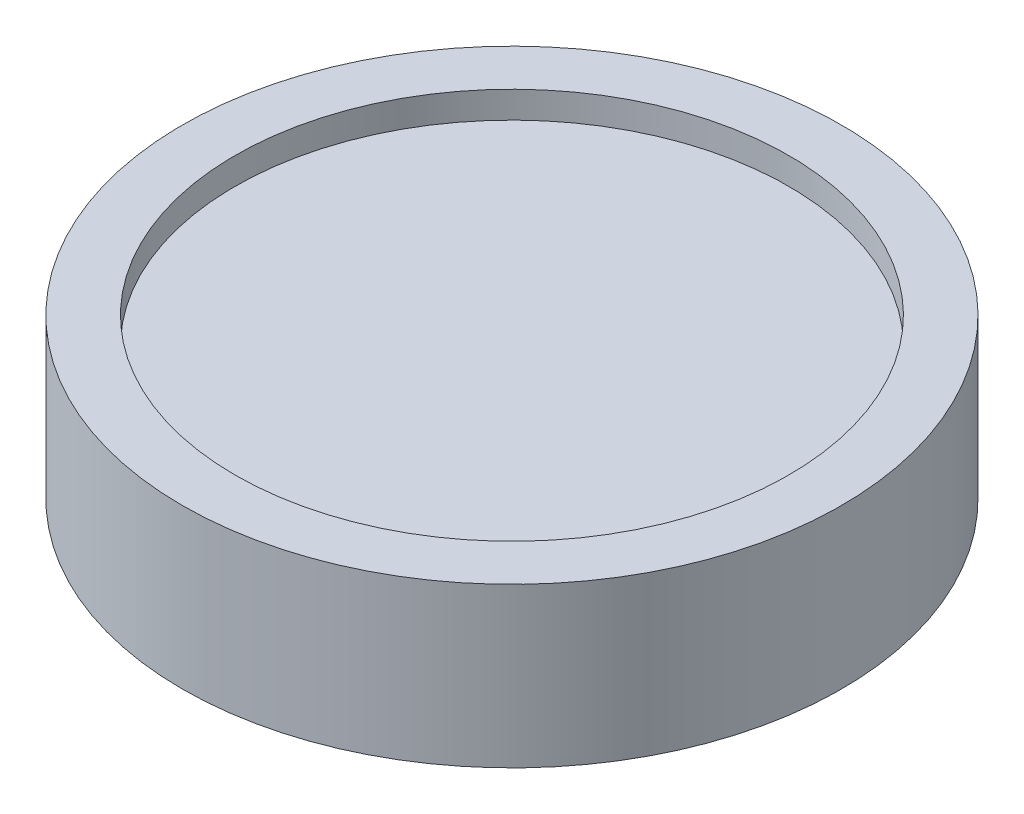
ISO-10303-21;
HEADER;
FILE_DESCRIPTION(('STEP AP214'),'2;1');
FILE_NAME('part.step','',(''),(''),'','','');
FILE_SCHEMA(('AUTOMOTIVE_DESIGN { 1 0 10303 214 1 1 1 1 }'));
ENDSEC;
DATA;
#1=APPLICATION_CONTEXT('core data for automotive mechanical design processes');
#2=APPLICATION_PROTOCOL_DEFINITION('international standard','automotive_design',2000,#1);
#3=PRODUCT_CONTEXT('',#1,'mechanical');
#4=PRODUCT('Part','Part','',(#3));
#5=PRODUCT_RELATED_PRODUCT_CATEGORY('part','',(#4));
#6=PRODUCT_DEFINITION_FORMATION('','',#4);
#7=PRODUCT_DEFINITION_CONTEXT('part definition',#1,'design');
#8=PRODUCT_DEFINITION('design','',#6,#7);
#9=PRODUCT_DEFINITION_SHAPE('','',#8);
#10=(LENGTH_UNIT() NAMED_UNIT(*) SI_UNIT(.MILLI.,.METRE.));
#11=(NAMED_UNIT(*) PLANE_ANGLE_UNIT() SI_UNIT($,.RADIAN.));
#12=(NAMED_UNIT(*) SI_UNIT($,.STERADIAN.) SOLID_ANGLE_UNIT());
#13=UNCERTAINTY_MEASURE_WITH_UNIT(LENGTH_MEASURE(1.E-05),#10,'distance_accuracy_value','');
#14=(GEOMETRIC_REPRESENTATION_CONTEXT(3) GLOBAL_UNCERTAINTY_ASSIGNED_CONTEXT((#13)) GLOBAL_UNIT_ASSIGNED_CONTEXT((#10,
#11,#12)) REPRESENTATION_CONTEXT('',''));
#15=CARTESIAN_POINT('',(0.,0.,0.));
#16=DIRECTION('',(0.,0.,1.));
#17=DIRECTION('',(1.,0.,0.));
#18=AXIS2_PLACEMENT_3D('',#15,#16,#17);
#19=CARTESIAN_POINT('',(0.,2.,0.));
#20=DIRECTION('',(0.,1.,0.));
#21=DIRECTION('',(0.,0.,1.));
#22=AXIS2_PLACEMENT_3D('',#19,#20,#21);
#23=PLANE('',#22);
#24=CARTESIAN_POINT('',(0.,2.,0.));
#25=DIRECTION('',(0.,1.,0.));
#26=DIRECTION('',(0.,0.,1.));
#27=AXIS2_PLACEMENT_3D('',#24,#25,#26);
#28=CIRCLE('',#27,10.5);
#29=CARTESIAN_POINT('',(0.,2.,10.5));
#30=VERTEX_POINT('',#29);
#31=EDGE_CURVE('E36',#30,#30,#28,.T.);
#32=ORIENTED_EDGE('',*,*,#31,.T.);
#33=EDGE_LOOP('',(#32));
#34=FACE_BOUND('',#33,.T.);
#35=ADVANCED_FACE('F30',(#34),#23,.T.);
#36=CARTESIAN_POINT('',(0.,-3.015,0.));
#37=DIRECTION('',(0.,1.,0.));
#38=DIRECTION('',(0.,0.,1.));
#39=AXIS2_PLACEMENT_3D('',#36,#37,#38);
#40=CYLINDRICAL_SURFACE('',#39,10.5);
#41=CARTESIAN_POINT('',(0.,-3.015,0.));
#42=DIRECTION('',(0.,1.,0.));
#43=DIRECTION('',(0.,0.,1.));
#44=AXIS2_PLACEMENT_3D('',#41,#42,#43);
#45=CIRCLE('',#44,10.5);
#46=CARTESIAN_POINT('',(0.,-3.015,10.5));
#47=VERTEX_POINT('',#46);
#48=EDGE_CURVE('E44',#47,#47,#45,.T.);
#49=ORIENTED_EDGE('',*,*,#48,.F.);
#50=EDGE_LOOP('',(#49));
#51=FACE_BOUND('',#50,.T.);
#52=CARTESIAN_POINT('',(0.,-2.,0.));
#53=DIRECTION('',(0.,1.,0.));
#54=DIRECTION('',(0.,0.,1.));
#55=AXIS2_PLACEMENT_3D('',#52,#53,#54);
#56=CIRCLE('',#55,10.5);
#57=CARTESIAN_POINT('',(0.,-2.,10.5));
#58=VERTEX_POINT('',#57);
#59=EDGE_CURVE('E10',#58,#58,#56,.T.);
#60=ORIENTED_EDGE('',*,*,#59,.T.);
#61=EDGE_LOOP('',(#60));
#62=FACE_BOUND('',#61,.T.);
#63=ADVANCED_FACE('F71',(#51,#62),#40,.F.);
#64=CARTESIAN_POINT('',(0.,-3.015,0.));
#65=DIRECTION('',(0.,1.,0.));
#66=DIRECTION('',(0.,0.,1.));
#67=AXIS2_PLACEMENT_3D('',#64,#65,#66);
#68=CYLINDRICAL_SURFACE('',#67,12.5);
#69=CARTESIAN_POINT('',(0.,-3.015,0.));
#70=DIRECTION('',(0.,1.,0.));
#71=DIRECTION('',(0.,0.,1.));
#72=AXIS2_PLACEMENT_3D('',#69,#70,#71);
#73=CIRCLE('',#72,12.5);
#74=CARTESIAN_POINT('',(0.,-3.015,12.5));
#75=VERTEX_POINT('',#74);
#76=EDGE_CURVE('E40',#75,#75,#73,.T.);
#77=ORIENTED_EDGE('',*,*,#76,.T.);
#78=EDGE_LOOP('',(#77));
#79=FACE_BOUND('',#78,.T.);
#80=CARTESIAN_POINT('',(0.,3.015,0.));
#81=DIRECTION('',(0.,1.,0.));
#82=DIRECTION('',(0.,0.,1.));
#83=AXIS2_PLACEMENT_3D('',#80,#81,#82);
#84=CIRCLE('',#83,12.5);
#85=CARTESIAN_POINT('',(0.,3.015,12.5));
#86=VERTEX_POINT('',#85);
#87=EDGE_CURVE('E49',#86,#86,#84,.T.);
#88=ORIENTED_EDGE('',*,*,#87,.F.);
#89=EDGE_LOOP('',(#88));
#90=FACE_BOUND('',#89,.T.);
#91=ADVANCED_FACE('F76',(#79,#90),#68,.T.);
#92=CARTESIAN_POINT('',(0.,-3.015,0.));
#93=DIRECTION('',(0.,1.,0.));
#94=DIRECTION('',(0.,0.,1.));
#95=AXIS2_PLACEMENT_3D('',#92,#93,#94);
#96=PLANE('',#95);
#97=ORIENTED_EDGE('',*,*,#48,.T.);
#98=EDGE_LOOP('',(#97));
#99=FACE_BOUND('',#98,.T.);
#100=ORIENTED_EDGE('',*,*,#76,.F.);
#101=EDGE_LOOP('',(#100));
#102=FACE_BOUND('',#101,.T.);
#103=ADVANCED_FACE('F68',(#99,#102),#96,.F.);
#104=ORIENTED_EDGE('',*,*,#31,.F.);
#105=EDGE_LOOP('',(#104));
#106=FACE_BOUND('',#105,.T.);
#107=CARTESIAN_POINT('',(0.,3.015,0.));
#108=DIRECTION('',(0.,1.,0.));
#109=DIRECTION('',(0.,0.,1.));
#110=AXIS2_PLACEMENT_3D('',#107,#108,#109);
#111=CIRCLE('',#110,10.5);
#112=CARTESIAN_POINT('',(0.,3.015,10.5));
#113=VERTEX_POINT('',#112);
#114=EDGE_CURVE('E52',#113,#113,#111,.T.);
#115=ORIENTED_EDGE('',*,*,#114,.T.);
#116=EDGE_LOOP('',(#115));
#117=FACE_BOUND('',#116,.T.);
#118=ADVANCED_FACE('F56',(#106,#117),#40,.F.);
#119=CARTESIAN_POINT('',(0.,3.015,0.));
#120=DIRECTION('',(0.,1.,0.));
#121=DIRECTION('',(0.,0.,1.));
#122=AXIS2_PLACEMENT_3D('',#119,#120,#121);
#123=PLANE('',#122);
#124=ORIENTED_EDGE('',*,*,#87,.T.);
#125=EDGE_LOOP('',(#124));
#126=FACE_BOUND('',#125,.T.);
#127=ORIENTED_EDGE('',*,*,#114,.F.);
#128=EDGE_LOOP('',(#127));
#129=FACE_BOUND('',#128,.T.);
#130=ADVANCED_FACE('F58',(#126,#129),#123,.T.);
#131=CARTESIAN_POINT('',(0.,-2.,0.));
#132=DIRECTION('',(0.,1.,0.));
#133=DIRECTION('',(0.,0.,1.));
#134=AXIS2_PLACEMENT_3D('',#131,#132,#133);
#135=PLANE('',#134);
#136=ORIENTED_EDGE('',*,*,#59,.F.);
#137=EDGE_LOOP('',(#136));
#138=FACE_BOUND('',#137,.T.);
#139=ADVANCED_FACE('F60',(#138),#135,.F.);
#140=CLOSED_SHELL('',(#35,#63,#91,#103,#118,#130,#139));
#141=MANIFOLD_SOLID_BREP('B2',#140);
#142=ADVANCED_BREP_SHAPE_REPRESENTATION('',(#18,#141),#14);
#143=SHAPE_DEFINITION_REPRESENTATION(#9,#142);
ENDSEC;
END-ISO-10303-21;
